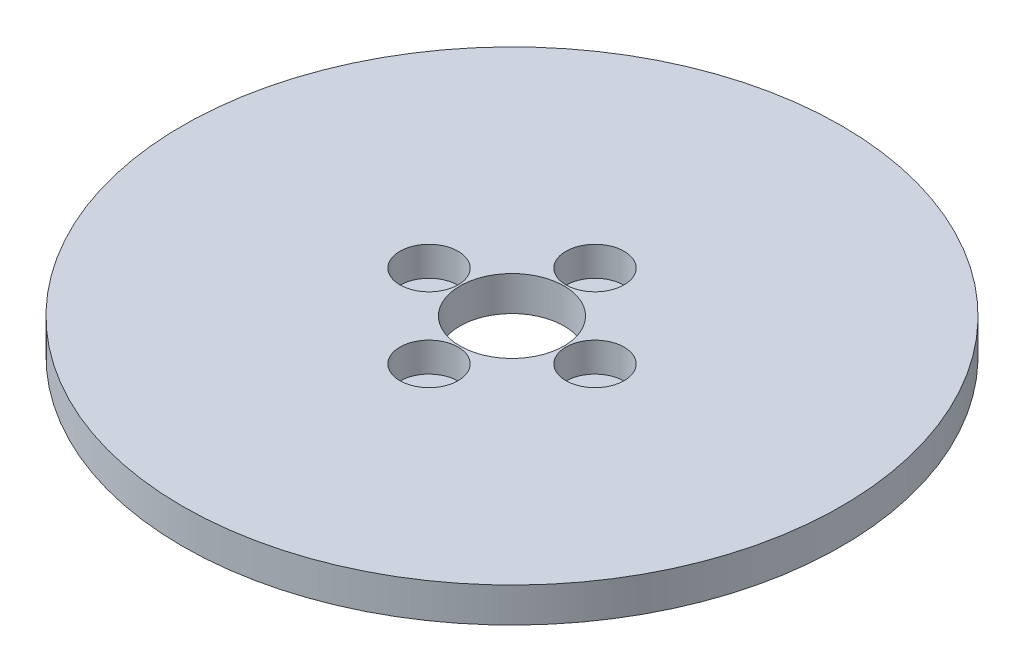
ISO-10303-21;
HEADER;
FILE_DESCRIPTION(('STEP AP214'),'2;1');
FILE_NAME('part.step','',(''),(''),'','','');
FILE_SCHEMA(('AUTOMOTIVE_DESIGN { 1 0 10303 214 1 1 1 1 }'));
ENDSEC;
DATA;
#1=APPLICATION_CONTEXT('core data for automotive mechanical design processes');
#2=APPLICATION_PROTOCOL_DEFINITION('international standard','automotive_design',2000,#1);
#3=PRODUCT_CONTEXT('',#1,'mechanical');
#4=PRODUCT('Part','Part','',(#3));
#5=PRODUCT_RELATED_PRODUCT_CATEGORY('part','',(#4));
#6=PRODUCT_DEFINITION_FORMATION('','',#4);
#7=PRODUCT_DEFINITION_CONTEXT('part definition',#1,'design');
#8=PRODUCT_DEFINITION('design','',#6,#7);
#9=PRODUCT_DEFINITION_SHAPE('','',#8);
#10=(LENGTH_UNIT() NAMED_UNIT(*) SI_UNIT(.MILLI.,.METRE.));
#11=(NAMED_UNIT(*) PLANE_ANGLE_UNIT() SI_UNIT($,.RADIAN.));
#12=(NAMED_UNIT(*) SI_UNIT($,.STERADIAN.) SOLID_ANGLE_UNIT());
#13=UNCERTAINTY_MEASURE_WITH_UNIT(LENGTH_MEASURE(1.E-05),#10,'distance_accuracy_value','');
#14=(GEOMETRIC_REPRESENTATION_CONTEXT(3) GLOBAL_UNCERTAINTY_ASSIGNED_CONTEXT((#13)) GLOBAL_UNIT_ASSIGNED_CONTEXT((#10,
#11,#12)) REPRESENTATION_CONTEXT('',''));
#15=CARTESIAN_POINT('',(0.,0.,0.));
#16=DIRECTION('',(0.,0.,1.));
#17=DIRECTION('',(1.,0.,0.));
#18=AXIS2_PLACEMENT_3D('',#15,#16,#17);
#19=CARTESIAN_POINT('',(0.,5.,0.));
#20=DIRECTION('',(0.,-1.,0.));
#21=DIRECTION('',(0.,0.,-1.));
#22=AXIS2_PLACEMENT_3D('',#19,#20,#21);
#23=CYLINDRICAL_SURFACE('',#22,47.5);
#24=CARTESIAN_POINT('',(0.,5.,0.));
#25=DIRECTION('',(0.,1.,0.));
#26=DIRECTION('',(0.,0.,1.));
#27=AXIS2_PLACEMENT_3D('',#24,#25,#26);
#28=CIRCLE('',#27,47.5);
#29=CARTESIAN_POINT('',(0.,5.,47.5));
#30=VERTEX_POINT('',#29);
#31=EDGE_CURVE('E10',#30,#30,#28,.T.);
#32=ORIENTED_EDGE('',*,*,#31,.F.);
#33=EDGE_LOOP('',(#32));
#34=FACE_BOUND('',#33,.T.);
#35=CARTESIAN_POINT('',(0.,0.,0.));
#36=DIRECTION('',(0.,1.,0.));
#37=DIRECTION('',(0.,0.,1.));
#38=AXIS2_PLACEMENT_3D('',#35,#36,#37);
#39=CIRCLE('',#38,47.5);
#40=CARTESIAN_POINT('',(0.,0.,47.5));
#41=VERTEX_POINT('',#40);
#42=EDGE_CURVE('E37',#41,#41,#39,.T.);
#43=ORIENTED_EDGE('',*,*,#42,.T.);
#44=EDGE_LOOP('',(#43));
#45=FACE_BOUND('',#44,.T.);
#46=ADVANCED_FACE('F40',(#34,#45),#23,.T.);
#47=CARTESIAN_POINT('',(0.,5.,0.));
#48=DIRECTION('',(0.,1.,0.));
#49=DIRECTION('',(0.,0.,1.));
#50=AXIS2_PLACEMENT_3D('',#47,#48,#49);
#51=PLANE('',#50);
#52=CARTESIAN_POINT('',(0.,5.,11.9621215251771));
#53=DIRECTION('',(0.,1.,0.));
#54=DIRECTION('',(1.,0.,0.));
#55=AXIS2_PLACEMENT_3D('',#52,#53,#54);
#56=CIRCLE('',#55,4.19943041946625);
#57=CARTESIAN_POINT('',(4.1994304194663,5.,11.962121525177));
#58=VERTEX_POINT('',#57);
#59=EDGE_CURVE('E71',#58,#58,#56,.T.);
#60=ORIENTED_EDGE('',*,*,#59,.F.);
#61=EDGE_LOOP('',(#60));
#62=FACE_BOUND('',#61,.T.);
#63=CARTESIAN_POINT('',(11.9621215251771,5.,0.));
#64=DIRECTION('',(0.,1.,0.));
#65=DIRECTION('',(0.,0.,-1.));
#66=AXIS2_PLACEMENT_3D('',#63,#64,#65);
#67=CIRCLE('',#66,4.19943041946625);
#68=CARTESIAN_POINT('',(11.9621215251771,5.,-4.19943041946625));
#69=VERTEX_POINT('',#68);
#70=EDGE_CURVE('E70',#69,#69,#67,.T.);
#71=ORIENTED_EDGE('',*,*,#70,.F.);
#72=EDGE_LOOP('',(#71));
#73=FACE_BOUND('',#72,.T.);
#74=CARTESIAN_POINT('',(-1.25296572234388E-13,5.,-11.9621215251771));
#75=DIRECTION('',(0.,1.,0.));
#76=DIRECTION('',(-1.,0.,0.));
#77=AXIS2_PLACEMENT_3D('',#74,#75,#76);
#78=CIRCLE('',#77,4.19943041946625);
#79=CARTESIAN_POINT('',(-4.19943041946638,5.,-11.962121525177));
#80=VERTEX_POINT('',#79);
#81=EDGE_CURVE('E61',#80,#80,#78,.T.);
#82=ORIENTED_EDGE('',*,*,#81,.F.);
#83=EDGE_LOOP('',(#82));
#84=FACE_BOUND('',#83,.T.);
#85=CARTESIAN_POINT('',(-11.9621215251771,5.,0.));
#86=DIRECTION('',(0.,1.,0.));
#87=DIRECTION('',(0.,0.,1.));
#88=AXIS2_PLACEMENT_3D('',#85,#86,#87);
#89=CIRCLE('',#88,4.19943041946625);
#90=CARTESIAN_POINT('',(-11.9621215251771,5.,4.19943041946625));
#91=VERTEX_POINT('',#90);
#92=EDGE_CURVE('E54',#91,#91,#89,.T.);
#93=ORIENTED_EDGE('',*,*,#92,.F.);
#94=EDGE_LOOP('',(#93));
#95=FACE_BOUND('',#94,.T.);
#96=CARTESIAN_POINT('',(0.,5.,0.));
#97=DIRECTION('',(0.,1.,0.));
#98=DIRECTION('',(0.,0.,1.));
#99=AXIS2_PLACEMENT_3D('',#96,#97,#98);
#100=CIRCLE('',#99,7.5);
#101=CARTESIAN_POINT('',(0.,5.,7.5));
#102=VERTEX_POINT('',#101);
#103=EDGE_CURVE('E50',#102,#102,#100,.T.);
#104=ORIENTED_EDGE('',*,*,#103,.F.);
#105=EDGE_LOOP('',(#104));
#106=FACE_BOUND('',#105,.T.);
#107=ORIENTED_EDGE('',*,*,#31,.T.);
#108=EDGE_LOOP('',(#107));
#109=FACE_BOUND('',#108,.T.);
#110=ADVANCED_FACE('F86',(#62,#73,#84,#95,#106,#109),#51,.T.);
#111=CARTESIAN_POINT('',(0.,0.,0.));
#112=DIRECTION('',(0.,1.,0.));
#113=DIRECTION('',(0.,0.,1.));
#114=AXIS2_PLACEMENT_3D('',#111,#112,#113);
#115=PLANE('',#114);
#116=CARTESIAN_POINT('',(0.,0.,0.));
#117=DIRECTION('',(0.,1.,0.));
#118=DIRECTION('',(0.,0.,1.));
#119=AXIS2_PLACEMENT_3D('',#116,#117,#118);
#120=CIRCLE('',#119,7.5);
#121=CARTESIAN_POINT('',(0.,0.,7.5));
#122=VERTEX_POINT('',#121);
#123=EDGE_CURVE('E47',#122,#122,#120,.T.);
#124=ORIENTED_EDGE('',*,*,#123,.T.);
#125=EDGE_LOOP('',(#124));
#126=FACE_BOUND('',#125,.T.);
#127=ORIENTED_EDGE('',*,*,#42,.F.);
#128=EDGE_LOOP('',(#127));
#129=FACE_BOUND('',#128,.T.);
#130=ADVANCED_FACE('F93',(#126,#129),#115,.F.);
#131=CARTESIAN_POINT('',(0.,5.,0.));
#132=DIRECTION('',(0.,-1.,0.));
#133=DIRECTION('',(0.,0.,-1.));
#134=AXIS2_PLACEMENT_3D('',#131,#132,#133);
#135=CYLINDRICAL_SURFACE('',#134,7.5);
#136=ORIENTED_EDGE('',*,*,#103,.T.);
#137=EDGE_LOOP('',(#136));
#138=FACE_BOUND('',#137,.T.);
#139=ORIENTED_EDGE('',*,*,#123,.F.);
#140=EDGE_LOOP('',(#139));
#141=FACE_BOUND('',#140,.T.);
#142=ADVANCED_FACE('F101',(#138,#141),#135,.F.);
#143=CARTESIAN_POINT('',(-11.9621215251771,0.754077674721063,0.));
#144=DIRECTION('',(0.,1.,0.));
#145=DIRECTION('',(0.,0.,1.));
#146=AXIS2_PLACEMENT_3D('',#143,#144,#145);
#147=CYLINDRICAL_SURFACE('',#146,4.19943041946625);
#148=CARTESIAN_POINT('',(-11.9621215251771,0.754077674721063,0.));
#149=DIRECTION('',(0.,1.,0.));
#150=DIRECTION('',(0.,0.,1.));
#151=AXIS2_PLACEMENT_3D('',#148,#149,#150);
#152=CIRCLE('',#151,4.19943041946625);
#153=CARTESIAN_POINT('',(-11.9621215251771,0.754077674721063,4.19943041946625));
#154=VERTEX_POINT('',#153);
#155=EDGE_CURVE('E55',#154,#154,#152,.T.);
#156=ORIENTED_EDGE('',*,*,#155,.F.);
#157=EDGE_LOOP('',(#156));
#158=FACE_BOUND('',#157,.T.);
#159=ORIENTED_EDGE('',*,*,#92,.T.);
#160=EDGE_LOOP('',(#159));
#161=FACE_BOUND('',#160,.T.);
#162=ADVANCED_FACE('F102',(#158,#161),#147,.F.);
#163=CARTESIAN_POINT('',(-11.9621215251771,0.754077674721063,0.));
#164=DIRECTION('',(0.,1.,0.));
#165=DIRECTION('',(0.,0.,1.));
#166=AXIS2_PLACEMENT_3D('',#163,#164,#165);
#167=PLANE('',#166);
#168=ORIENTED_EDGE('',*,*,#155,.T.);
#169=EDGE_LOOP('',(#168));
#170=FACE_BOUND('',#169,.T.);
#171=ADVANCED_FACE('F133',(#170),#167,.T.);
#172=CARTESIAN_POINT('',(-1.25296572234388E-13,0.754077674721063,-11.9621215251771));
#173=DIRECTION('',(0.,1.,0.));
#174=DIRECTION('',(0.,0.,1.));
#175=AXIS2_PLACEMENT_3D('',#172,#173,#174);
#176=CYLINDRICAL_SURFACE('',#175,4.19943041946625);
#177=CARTESIAN_POINT('',(-1.25296572234388E-13,0.754077674721063,-11.9621215251771));
#178=DIRECTION('',(0.,1.,0.));
#179=DIRECTION('',(-1.,0.,0.));
#180=AXIS2_PLACEMENT_3D('',#177,#178,#179);
#181=CIRCLE('',#180,4.19943041946625);
#182=CARTESIAN_POINT('',(-4.19943041946638,0.754077674721063,-11.962121525177));
#183=VERTEX_POINT('',#182);
#184=EDGE_CURVE('E63',#183,#183,#181,.T.);
#185=ORIENTED_EDGE('',*,*,#184,.F.);
#186=EDGE_LOOP('',(#185));
#187=FACE_BOUND('',#186,.T.);
#188=ORIENTED_EDGE('',*,*,#81,.T.);
#189=EDGE_LOOP('',(#188));
#190=FACE_BOUND('',#189,.T.);
#191=ADVANCED_FACE('F142',(#187,#190),#176,.F.);
#192=CARTESIAN_POINT('',(-1.25296572234388E-13,0.754077674721063,-11.9621215251771));
#193=DIRECTION('',(0.,1.,0.));
#194=DIRECTION('',(-1.,0.,0.));
#195=AXIS2_PLACEMENT_3D('',#192,#193,#194);
#196=PLANE('',#195);
#197=ORIENTED_EDGE('',*,*,#184,.T.);
#198=EDGE_LOOP('',(#197));
#199=FACE_BOUND('',#198,.T.);
#200=ADVANCED_FACE('F156',(#199),#196,.T.);
#201=CARTESIAN_POINT('',(11.9621215251771,0.754077674721063,0.));
#202=DIRECTION('',(0.,1.,0.));
#203=DIRECTION('',(0.,0.,1.));
#204=AXIS2_PLACEMENT_3D('',#201,#202,#203);
#205=CYLINDRICAL_SURFACE('',#204,4.19943041946625);
#206=CARTESIAN_POINT('',(11.9621215251771,0.754077674721063,0.));
#207=DIRECTION('',(0.,1.,0.));
#208=DIRECTION('',(0.,0.,-1.));
#209=AXIS2_PLACEMENT_3D('',#206,#207,#208);
#210=CIRCLE('',#209,4.19943041946625);
#211=CARTESIAN_POINT('',(11.9621215251771,0.754077674721063,-4.19943041946625));
#212=VERTEX_POINT('',#211);
#213=EDGE_CURVE('E69',#212,#212,#210,.T.);
#214=ORIENTED_EDGE('',*,*,#213,.F.);
#215=EDGE_LOOP('',(#214));
#216=FACE_BOUND('',#215,.T.);
#217=ORIENTED_EDGE('',*,*,#70,.T.);
#218=EDGE_LOOP('',(#217));
#219=FACE_BOUND('',#218,.T.);
#220=ADVANCED_FACE('F164',(#216,#219),#205,.F.);
#221=CARTESIAN_POINT('',(11.9621215251771,0.754077674721063,0.));
#222=DIRECTION('',(0.,1.,0.));
#223=DIRECTION('',(0.,0.,-1.));
#224=AXIS2_PLACEMENT_3D('',#221,#222,#223);
#225=PLANE('',#224);
#226=ORIENTED_EDGE('',*,*,#213,.T.);
#227=EDGE_LOOP('',(#226));
#228=FACE_BOUND('',#227,.T.);
#229=ADVANCED_FACE('F83',(#228),#225,.T.);
#230=CARTESIAN_POINT('',(0.,0.754077674721063,11.9621215251771));
#231=DIRECTION('',(0.,1.,0.));
#232=DIRECTION('',(0.,0.,1.));
#233=AXIS2_PLACEMENT_3D('',#230,#231,#232);
#234=CYLINDRICAL_SURFACE('',#233,4.19943041946625);
#235=CARTESIAN_POINT('',(0.,0.754077674721063,11.9621215251771));
#236=DIRECTION('',(0.,1.,0.));
#237=DIRECTION('',(1.,0.,0.));
#238=AXIS2_PLACEMENT_3D('',#235,#236,#237);
#239=CIRCLE('',#238,4.19943041946625);
#240=CARTESIAN_POINT('',(4.1994304194663,0.754077674721063,11.962121525177));
#241=VERTEX_POINT('',#240);
#242=EDGE_CURVE('E59',#241,#241,#239,.T.);
#243=ORIENTED_EDGE('',*,*,#242,.F.);
#244=EDGE_LOOP('',(#243));
#245=FACE_BOUND('',#244,.T.);
#246=ORIENTED_EDGE('',*,*,#59,.T.);
#247=EDGE_LOOP('',(#246));
#248=FACE_BOUND('',#247,.T.);
#249=ADVANCED_FACE('F81',(#245,#248),#234,.F.);
#250=CARTESIAN_POINT('',(0.,0.754077674721063,11.9621215251771));
#251=DIRECTION('',(0.,1.,0.));
#252=DIRECTION('',(1.,0.,0.));
#253=AXIS2_PLACEMENT_3D('',#250,#251,#252);
#254=PLANE('',#253);
#255=ORIENTED_EDGE('',*,*,#242,.T.);
#256=EDGE_LOOP('',(#255));
#257=FACE_BOUND('',#256,.T.);
#258=ADVANCED_FACE('F78',(#257),#254,.T.);
#259=CLOSED_SHELL('',(#46,#110,#130,#142,#162,#171,#191,#200,#220,#229,#249,#258));
#260=MANIFOLD_SOLID_BREP('B2',#259);
#261=ADVANCED_BREP_SHAPE_REPRESENTATION('',(#18,#260),#14);
#262=SHAPE_DEFINITION_REPRESENTATION(#9,#261);
ENDSEC;
END-ISO-10303-21;
